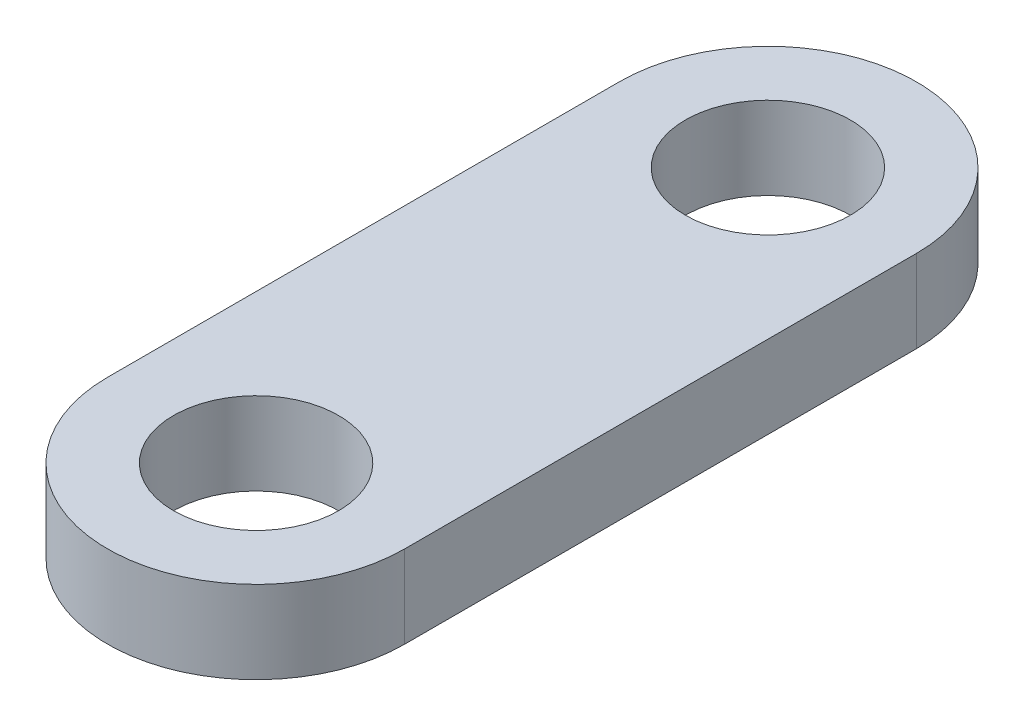
ISO-10303-21;
HEADER;
FILE_DESCRIPTION(('STEP AP214'),'2;1');
FILE_NAME('part.step','',(''),(''),'','','');
FILE_SCHEMA(('AUTOMOTIVE_DESIGN { 1 0 10303 214 1 1 1 1 }'));
ENDSEC;
DATA;
#1=APPLICATION_CONTEXT('core data for automotive mechanical design processes');
#2=APPLICATION_PROTOCOL_DEFINITION('international standard','automotive_design',2000,#1);
#3=PRODUCT_CONTEXT('',#1,'mechanical');
#4=PRODUCT('Part','Part','',(#3));
#5=PRODUCT_RELATED_PRODUCT_CATEGORY('part','',(#4));
#6=PRODUCT_DEFINITION_FORMATION('','',#4);
#7=PRODUCT_DEFINITION_CONTEXT('part definition',#1,'design');
#8=PRODUCT_DEFINITION('design','',#6,#7);
#9=PRODUCT_DEFINITION_SHAPE('','',#8);
#10=(LENGTH_UNIT() NAMED_UNIT(*) SI_UNIT(.MILLI.,.METRE.));
#11=(NAMED_UNIT(*) PLANE_ANGLE_UNIT() SI_UNIT($,.RADIAN.));
#12=(NAMED_UNIT(*) SI_UNIT($,.STERADIAN.) SOLID_ANGLE_UNIT());
#13=UNCERTAINTY_MEASURE_WITH_UNIT(LENGTH_MEASURE(1.E-05),#10,'distance_accuracy_value','');
#14=(GEOMETRIC_REPRESENTATION_CONTEXT(3) GLOBAL_UNCERTAINTY_ASSIGNED_CONTEXT((#13)) GLOBAL_UNIT_ASSIGNED_CONTEXT((#10,
#11,#12)) REPRESENTATION_CONTEXT('',''));
#15=CARTESIAN_POINT('',(0.,0.,0.));
#16=DIRECTION('',(0.,0.,1.));
#17=DIRECTION('',(1.,0.,0.));
#18=AXIS2_PLACEMENT_3D('',#15,#16,#17);
#19=CARTESIAN_POINT('',(0.,5.,0.));
#20=DIRECTION('',(0.,1.,0.));
#21=DIRECTION('',(0.,0.,1.));
#22=AXIS2_PLACEMENT_3D('',#19,#20,#21);
#23=PLANE('',#22);
#24=CARTESIAN_POINT('',(0.,5.,0.));
#25=DIRECTION('',(0.,1.,0.));
#26=DIRECTION('',(0.,0.,1.));
#27=AXIS2_PLACEMENT_3D('',#24,#25,#26);
#28=CIRCLE('',#27,5.);
#29=CARTESIAN_POINT('',(0.,5.,5.));
#30=VERTEX_POINT('',#29);
#31=EDGE_CURVE('E100',#30,#30,#28,.T.);
#32=ORIENTED_EDGE('',*,*,#31,.F.);
#33=EDGE_LOOP('',(#32));
#34=FACE_BOUND('',#33,.T.);
#35=CARTESIAN_POINT('',(0.,5.,0.));
#36=DIRECTION('',(0.,1.,0.));
#37=DIRECTION('',(0.,0.,1.));
#38=AXIS2_PLACEMENT_3D('',#35,#36,#37);
#39=CIRCLE('',#38,9.);
#40=CARTESIAN_POINT('',(9.,5.,0.));
#41=VERTEX_POINT('',#40);
#42=CARTESIAN_POINT('',(-9.,5.,0.));
#43=VERTEX_POINT('',#42);
#44=EDGE_CURVE('E85',#41,#43,#39,.T.);
#45=ORIENTED_EDGE('',*,*,#44,.T.);
#46=DIRECTION('',(0.,0.,1.));
#47=VECTOR('',#46,1.);
#48=CARTESIAN_POINT('',(-9.,5.,0.));
#49=LINE('',#48,#47);
#50=CARTESIAN_POINT('',(-9.,5.,31.));
#51=VERTEX_POINT('',#50);
#52=EDGE_CURVE('E80',#43,#51,#49,.T.);
#53=ORIENTED_EDGE('',*,*,#52,.T.);
#54=CARTESIAN_POINT('',(0.,5.,31.));
#55=DIRECTION('',(0.,1.,0.));
#56=DIRECTION('',(0.,0.,1.));
#57=AXIS2_PLACEMENT_3D('',#54,#55,#56);
#58=CIRCLE('',#57,9.);
#59=CARTESIAN_POINT('',(9.,5.,31.));
#60=VERTEX_POINT('',#59);
#61=EDGE_CURVE('E83',#51,#60,#58,.T.);
#62=ORIENTED_EDGE('',*,*,#61,.T.);
#63=DIRECTION('',(0.,0.,-1.));
#64=VECTOR('',#63,1.);
#65=CARTESIAN_POINT('',(9.,5.,0.));
#66=LINE('',#65,#64);
#67=EDGE_CURVE('E50',#60,#41,#66,.T.);
#68=ORIENTED_EDGE('',*,*,#67,.T.);
#69=EDGE_LOOP('',(#45,#53,#62,#68));
#70=FACE_BOUND('',#69,.T.);
#71=CARTESIAN_POINT('',(0.,5.,31.));
#72=DIRECTION('',(0.,1.,0.));
#73=DIRECTION('',(0.,0.,1.));
#74=AXIS2_PLACEMENT_3D('',#71,#72,#73);
#75=CIRCLE('',#74,5.);
#76=CARTESIAN_POINT('',(0.,5.,36.));
#77=VERTEX_POINT('',#76);
#78=EDGE_CURVE('E115',#77,#77,#75,.T.);
#79=ORIENTED_EDGE('',*,*,#78,.F.);
#80=EDGE_LOOP('',(#79));
#81=FACE_BOUND('',#80,.T.);
#82=ADVANCED_FACE('F33',(#34,#70,#81),#23,.T.);
#83=CARTESIAN_POINT('',(0.,0.,0.));
#84=DIRECTION('',(0.,1.,0.));
#85=DIRECTION('',(0.,0.,1.));
#86=AXIS2_PLACEMENT_3D('',#83,#84,#85);
#87=PLANE('',#86);
#88=CARTESIAN_POINT('',(0.,0.,0.));
#89=DIRECTION('',(0.,1.,0.));
#90=DIRECTION('',(0.,0.,1.));
#91=AXIS2_PLACEMENT_3D('',#88,#89,#90);
#92=CIRCLE('',#91,9.);
#93=CARTESIAN_POINT('',(9.,0.,0.));
#94=VERTEX_POINT('',#93);
#95=CARTESIAN_POINT('',(-9.,0.,0.));
#96=VERTEX_POINT('',#95);
#97=EDGE_CURVE('E97',#94,#96,#92,.T.);
#98=ORIENTED_EDGE('',*,*,#97,.F.);
#99=DIRECTION('',(0.,0.,-1.));
#100=VECTOR('',#99,1.);
#101=CARTESIAN_POINT('',(9.,0.,0.));
#102=LINE('',#101,#100);
#103=CARTESIAN_POINT('',(9.,0.,31.));
#104=VERTEX_POINT('',#103);
#105=EDGE_CURVE('E73',#104,#94,#102,.T.);
#106=ORIENTED_EDGE('',*,*,#105,.F.);
#107=CARTESIAN_POINT('',(0.,0.,31.));
#108=DIRECTION('',(0.,1.,0.));
#109=DIRECTION('',(0.,0.,1.));
#110=AXIS2_PLACEMENT_3D('',#107,#108,#109);
#111=CIRCLE('',#110,9.);
#112=CARTESIAN_POINT('',(-9.,0.,31.));
#113=VERTEX_POINT('',#112);
#114=EDGE_CURVE('E67',#113,#104,#111,.T.);
#115=ORIENTED_EDGE('',*,*,#114,.F.);
#116=DIRECTION('',(0.,0.,1.));
#117=VECTOR('',#116,1.);
#118=CARTESIAN_POINT('',(-9.,0.,0.));
#119=LINE('',#118,#117);
#120=EDGE_CURVE('E89',#96,#113,#119,.T.);
#121=ORIENTED_EDGE('',*,*,#120,.F.);
#122=EDGE_LOOP('',(#98,#106,#115,#121));
#123=FACE_BOUND('',#122,.T.);
#124=CARTESIAN_POINT('',(0.,0.,0.));
#125=DIRECTION('',(0.,1.,0.));
#126=DIRECTION('',(0.,0.,1.));
#127=AXIS2_PLACEMENT_3D('',#124,#125,#126);
#128=CIRCLE('',#127,5.);
#129=CARTESIAN_POINT('',(0.,0.,5.));
#130=VERTEX_POINT('',#129);
#131=EDGE_CURVE('E112',#130,#130,#128,.T.);
#132=ORIENTED_EDGE('',*,*,#131,.T.);
#133=EDGE_LOOP('',(#132));
#134=FACE_BOUND('',#133,.T.);
#135=CARTESIAN_POINT('',(0.,0.,31.));
#136=DIRECTION('',(0.,1.,0.));
#137=DIRECTION('',(0.,0.,1.));
#138=AXIS2_PLACEMENT_3D('',#135,#136,#137);
#139=CIRCLE('',#138,5.);
#140=CARTESIAN_POINT('',(0.,0.,36.));
#141=VERTEX_POINT('',#140);
#142=EDGE_CURVE('E118',#141,#141,#139,.T.);
#143=ORIENTED_EDGE('',*,*,#142,.T.);
#144=EDGE_LOOP('',(#143));
#145=FACE_BOUND('',#144,.T.);
#146=ADVANCED_FACE('F108',(#123,#134,#145),#87,.F.);
#147=CARTESIAN_POINT('',(0.,5.,0.));
#148=DIRECTION('',(0.,-1.,0.));
#149=DIRECTION('',(0.,0.,-1.));
#150=AXIS2_PLACEMENT_3D('',#147,#148,#149);
#151=CYLINDRICAL_SURFACE('',#150,9.);
#152=ORIENTED_EDGE('',*,*,#97,.T.);
#153=DIRECTION('',(0.,-1.,0.));
#154=VECTOR('',#153,1.);
#155=CARTESIAN_POINT('',(-9.,5.,0.));
#156=LINE('',#155,#154);
#157=EDGE_CURVE('E11',#43,#96,#156,.T.);
#158=ORIENTED_EDGE('',*,*,#157,.F.);
#159=ORIENTED_EDGE('',*,*,#44,.F.);
#160=DIRECTION('',(0.,-1.,0.));
#161=VECTOR('',#160,1.);
#162=CARTESIAN_POINT('',(9.,5.,0.));
#163=LINE('',#162,#161);
#164=EDGE_CURVE('E93',#41,#94,#163,.T.);
#165=ORIENTED_EDGE('',*,*,#164,.T.);
#166=EDGE_LOOP('',(#152,#158,#159,#165));
#167=FACE_BOUND('',#166,.T.);
#168=ADVANCED_FACE('F35',(#167),#151,.T.);
#169=CARTESIAN_POINT('',(-9.,5.,0.));
#170=DIRECTION('',(1.,0.,0.));
#171=DIRECTION('',(0.,0.,-1.));
#172=AXIS2_PLACEMENT_3D('',#169,#170,#171);
#173=PLANE('',#172);
#174=ORIENTED_EDGE('',*,*,#120,.T.);
#175=DIRECTION('',(0.,-1.,0.));
#176=VECTOR('',#175,1.);
#177=CARTESIAN_POINT('',(-9.,5.,31.));
#178=LINE('',#177,#176);
#179=EDGE_CURVE('E42',#51,#113,#178,.T.);
#180=ORIENTED_EDGE('',*,*,#179,.F.);
#181=ORIENTED_EDGE('',*,*,#52,.F.);
#182=ORIENTED_EDGE('',*,*,#157,.T.);
#183=EDGE_LOOP('',(#174,#180,#181,#182));
#184=FACE_BOUND('',#183,.T.);
#185=ADVANCED_FACE('F88',(#184),#173,.F.);
#186=CARTESIAN_POINT('',(0.,5.,31.));
#187=DIRECTION('',(0.,-1.,0.));
#188=DIRECTION('',(0.,0.,-1.));
#189=AXIS2_PLACEMENT_3D('',#186,#187,#188);
#190=CYLINDRICAL_SURFACE('',#189,9.);
#191=ORIENTED_EDGE('',*,*,#114,.T.);
#192=DIRECTION('',(0.,-1.,0.));
#193=VECTOR('',#192,1.);
#194=CARTESIAN_POINT('',(9.,5.,31.));
#195=LINE('',#194,#193);
#196=EDGE_CURVE('E90',#60,#104,#195,.T.);
#197=ORIENTED_EDGE('',*,*,#196,.F.);
#198=ORIENTED_EDGE('',*,*,#61,.F.);
#199=ORIENTED_EDGE('',*,*,#179,.T.);
#200=EDGE_LOOP('',(#191,#197,#198,#199));
#201=FACE_BOUND('',#200,.T.);
#202=ADVANCED_FACE('F91',(#201),#190,.T.);
#203=CARTESIAN_POINT('',(9.,5.,0.));
#204=DIRECTION('',(-1.,0.,0.));
#205=DIRECTION('',(0.,0.,1.));
#206=AXIS2_PLACEMENT_3D('',#203,#204,#205);
#207=PLANE('',#206);
#208=ORIENTED_EDGE('',*,*,#105,.T.);
#209=ORIENTED_EDGE('',*,*,#164,.F.);
#210=ORIENTED_EDGE('',*,*,#67,.F.);
#211=ORIENTED_EDGE('',*,*,#196,.T.);
#212=EDGE_LOOP('',(#208,#209,#210,#211));
#213=FACE_BOUND('',#212,.T.);
#214=ADVANCED_FACE('F105',(#213),#207,.F.);
#215=CARTESIAN_POINT('',(0.,5.,0.));
#216=DIRECTION('',(0.,-1.,0.));
#217=DIRECTION('',(0.,0.,-1.));
#218=AXIS2_PLACEMENT_3D('',#215,#216,#217);
#219=CYLINDRICAL_SURFACE('',#218,5.);
#220=ORIENTED_EDGE('',*,*,#31,.T.);
#221=EDGE_LOOP('',(#220));
#222=FACE_BOUND('',#221,.T.);
#223=ORIENTED_EDGE('',*,*,#131,.F.);
#224=EDGE_LOOP('',(#223));
#225=FACE_BOUND('',#224,.T.);
#226=ADVANCED_FACE('F135',(#222,#225),#219,.F.);
#227=CARTESIAN_POINT('',(0.,5.,31.));
#228=DIRECTION('',(0.,-1.,0.));
#229=DIRECTION('',(0.,0.,-1.));
#230=AXIS2_PLACEMENT_3D('',#227,#228,#229);
#231=CYLINDRICAL_SURFACE('',#230,5.);
#232=ORIENTED_EDGE('',*,*,#78,.T.);
#233=EDGE_LOOP('',(#232));
#234=FACE_BOUND('',#233,.T.);
#235=ORIENTED_EDGE('',*,*,#142,.F.);
#236=EDGE_LOOP('',(#235));
#237=FACE_BOUND('',#236,.T.);
#238=ADVANCED_FACE('F124',(#234,#237),#231,.F.);
#239=CLOSED_SHELL('',(#82,#146,#168,#185,#202,#214,#226,#238));
#240=MANIFOLD_SOLID_BREP('B2',#239);
#241=ADVANCED_BREP_SHAPE_REPRESENTATION('',(#18,#240),#14);
#242=SHAPE_DEFINITION_REPRESENTATION(#9,#241);
ENDSEC;
END-ISO-10303-21;
